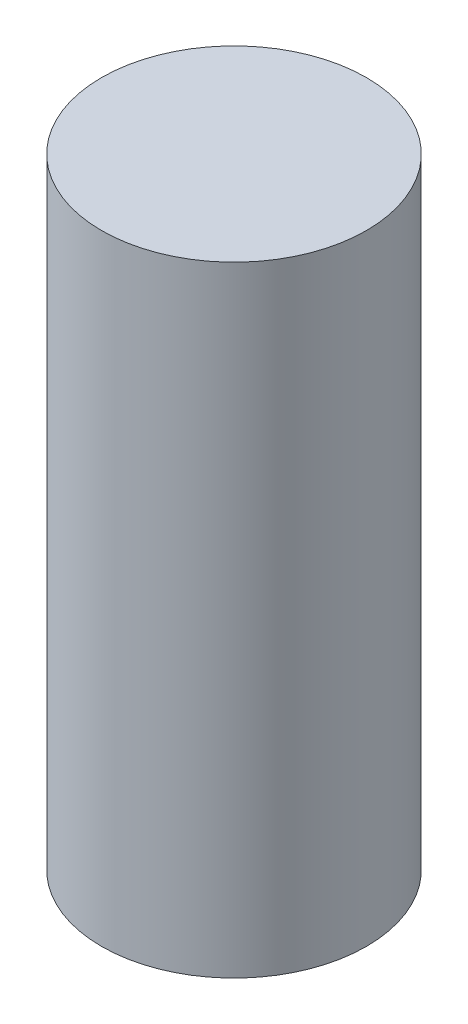
ISO-10303-21;
HEADER;
FILE_DESCRIPTION(('STEP AP214'),'2;1');
FILE_NAME('part.step','',(''),(''),'','','');
FILE_SCHEMA(('AUTOMOTIVE_DESIGN { 1 0 10303 214 1 1 1 1 }'));
ENDSEC;
DATA;
#1=APPLICATION_CONTEXT('core data for automotive mechanical design processes');
#2=APPLICATION_PROTOCOL_DEFINITION('international standard','automotive_design',2000,#1);
#3=PRODUCT_CONTEXT('',#1,'mechanical');
#4=PRODUCT('Part','Part','',(#3));
#5=PRODUCT_RELATED_PRODUCT_CATEGORY('part','',(#4));
#6=PRODUCT_DEFINITION_FORMATION('','',#4);
#7=PRODUCT_DEFINITION_CONTEXT('part definition',#1,'design');
#8=PRODUCT_DEFINITION('design','',#6,#7);
#9=PRODUCT_DEFINITION_SHAPE('','',#8);
#10=(LENGTH_UNIT() NAMED_UNIT(*) SI_UNIT(.MILLI.,.METRE.));
#11=(NAMED_UNIT(*) PLANE_ANGLE_UNIT() SI_UNIT($,.RADIAN.));
#12=(NAMED_UNIT(*) SI_UNIT($,.STERADIAN.) SOLID_ANGLE_UNIT());
#13=UNCERTAINTY_MEASURE_WITH_UNIT(LENGTH_MEASURE(1.E-05),#10,'distance_accuracy_value','');
#14=(GEOMETRIC_REPRESENTATION_CONTEXT(3) GLOBAL_UNCERTAINTY_ASSIGNED_CONTEXT((#13)) GLOBAL_UNIT_ASSIGNED_CONTEXT((#10,
#11,#12)) REPRESENTATION_CONTEXT('',''));
#15=CARTESIAN_POINT('',(0.,0.,0.));
#16=DIRECTION('',(0.,0.,1.));
#17=DIRECTION('',(1.,0.,0.));
#18=AXIS2_PLACEMENT_3D('',#15,#16,#17);
#19=CARTESIAN_POINT('',(0.,23.4,0.));
#20=DIRECTION('',(0.,-1.,0.));
#21=DIRECTION('',(0.,0.,-1.));
#22=AXIS2_PLACEMENT_3D('',#19,#20,#21);
#23=CYLINDRICAL_SURFACE('',#22,5.);
#24=CARTESIAN_POINT('',(0.,23.4,0.));
#25=DIRECTION('',(0.,1.,0.));
#26=DIRECTION('',(0.,0.,1.));
#27=AXIS2_PLACEMENT_3D('',#24,#25,#26);
#28=CIRCLE('',#27,5.);
#29=CARTESIAN_POINT('',(0.,23.4,5.));
#30=VERTEX_POINT('',#29);
#31=EDGE_CURVE('E10',#30,#30,#28,.T.);
#32=ORIENTED_EDGE('',*,*,#31,.F.);
#33=EDGE_LOOP('',(#32));
#34=FACE_BOUND('',#33,.T.);
#35=CARTESIAN_POINT('',(0.,0.,0.));
#36=DIRECTION('',(0.,1.,0.));
#37=DIRECTION('',(0.,0.,1.));
#38=AXIS2_PLACEMENT_3D('',#35,#36,#37);
#39=CIRCLE('',#38,5.);
#40=CARTESIAN_POINT('',(0.,0.,5.));
#41=VERTEX_POINT('',#40);
#42=EDGE_CURVE('E43',#41,#41,#39,.T.);
#43=ORIENTED_EDGE('',*,*,#42,.T.);
#44=EDGE_LOOP('',(#43));
#45=FACE_BOUND('',#44,.T.);
#46=ADVANCED_FACE('F40',(#34,#45),#23,.T.);
#47=CARTESIAN_POINT('',(0.,23.4,0.));
#48=DIRECTION('',(0.,1.,0.));
#49=DIRECTION('',(0.,0.,1.));
#50=AXIS2_PLACEMENT_3D('',#47,#48,#49);
#51=PLANE('',#50);
#52=ORIENTED_EDGE('',*,*,#31,.T.);
#53=EDGE_LOOP('',(#52));
#54=FACE_BOUND('',#53,.T.);
#55=ADVANCED_FACE('F73',(#54),#51,.T.);
#56=CARTESIAN_POINT('',(0.,0.,0.));
#57=DIRECTION('',(0.,1.,0.));
#58=DIRECTION('',(0.,0.,1.));
#59=AXIS2_PLACEMENT_3D('',#56,#57,#58);
#60=PLANE('',#59);
#61=CARTESIAN_POINT('',(0.,0.,0.));
#62=DIRECTION('',(0.,-1.,0.));
#63=DIRECTION('',(0.,0.,-1.));
#64=AXIS2_PLACEMENT_3D('',#61,#62,#63);
#65=CIRCLE('',#64,2.45);
#66=CARTESIAN_POINT('',(0.,0.,-2.45));
#67=VERTEX_POINT('',#66);
#68=EDGE_CURVE('E54',#67,#67,#65,.T.);
#69=ORIENTED_EDGE('',*,*,#68,.F.);
#70=EDGE_LOOP('',(#69));
#71=FACE_BOUND('',#70,.T.);
#72=ORIENTED_EDGE('',*,*,#42,.F.);
#73=EDGE_LOOP('',(#72));
#74=FACE_BOUND('',#73,.T.);
#75=ADVANCED_FACE('F67',(#71,#74),#60,.F.);
#76=CARTESIAN_POINT('',(0.,4.69,0.));
#77=DIRECTION('',(0.,-1.,0.));
#78=DIRECTION('',(0.,0.,-1.));
#79=AXIS2_PLACEMENT_3D('',#76,#77,#78);
#80=CYLINDRICAL_SURFACE('',#79,2.45);
#81=CARTESIAN_POINT('',(0.,4.69,0.));
#82=DIRECTION('',(0.,-1.,0.));
#83=DIRECTION('',(0.,0.,-1.));
#84=AXIS2_PLACEMENT_3D('',#81,#82,#83);
#85=CIRCLE('',#84,2.45);
#86=CARTESIAN_POINT('',(0.,4.69,-2.45));
#87=VERTEX_POINT('',#86);
#88=EDGE_CURVE('E52',#87,#87,#85,.T.);
#89=ORIENTED_EDGE('',*,*,#88,.F.);
#90=EDGE_LOOP('',(#89));
#91=FACE_BOUND('',#90,.T.);
#92=ORIENTED_EDGE('',*,*,#68,.T.);
#93=EDGE_LOOP('',(#92));
#94=FACE_BOUND('',#93,.T.);
#95=ADVANCED_FACE('F64',(#91,#94),#80,.F.);
#96=CARTESIAN_POINT('',(0.,4.69,0.));
#97=DIRECTION('',(0.,-1.,0.));
#98=DIRECTION('',(0.,0.,-1.));
#99=AXIS2_PLACEMENT_3D('',#96,#97,#98);
#100=PLANE('',#99);
#101=ORIENTED_EDGE('',*,*,#88,.T.);
#102=EDGE_LOOP('',(#101));
#103=FACE_BOUND('',#102,.T.);
#104=ADVANCED_FACE('F62',(#103),#100,.T.);
#105=CLOSED_SHELL('',(#46,#55,#75,#95,#104));
#106=MANIFOLD_SOLID_BREP('B2',#105);
#107=ADVANCED_BREP_SHAPE_REPRESENTATION('',(#18,#106),#14);
#108=SHAPE_DEFINITION_REPRESENTATION(#9,#107);
ENDSEC;
END-ISO-10303-21;
